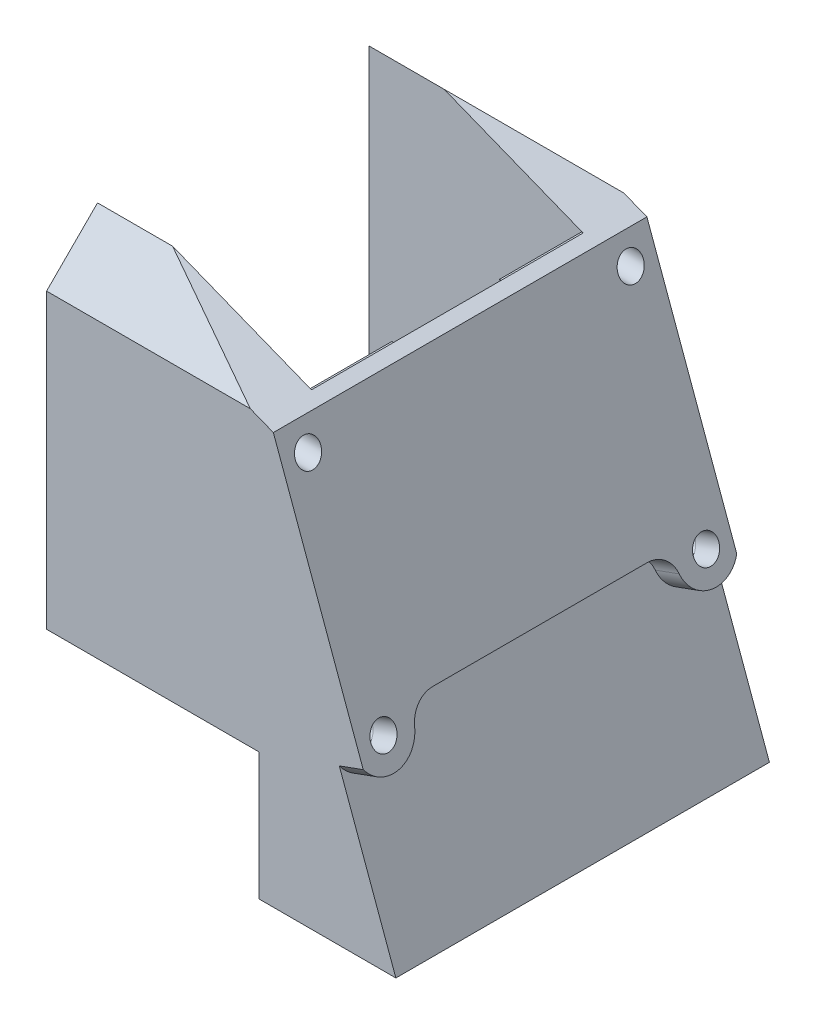
ISO-10303-21;
HEADER;
FILE_DESCRIPTION(('STEP AP214'),'2;1');
FILE_NAME('part.step','',(''),(''),'','','');
FILE_SCHEMA(('AUTOMOTIVE_DESIGN { 1 0 10303 214 1 1 1 1 }'));
ENDSEC;
DATA;
#1=APPLICATION_CONTEXT('core data for automotive mechanical design processes');
#2=APPLICATION_PROTOCOL_DEFINITION('international standard','automotive_design',2000,#1);
#3=PRODUCT_CONTEXT('',#1,'mechanical');
#4=PRODUCT('Part','Part','',(#3));
#5=PRODUCT_RELATED_PRODUCT_CATEGORY('part','',(#4));
#6=PRODUCT_DEFINITION_FORMATION('','',#4);
#7=PRODUCT_DEFINITION_CONTEXT('part definition',#1,'design');
#8=PRODUCT_DEFINITION('design','',#6,#7);
#9=PRODUCT_DEFINITION_SHAPE('','',#8);
#10=(LENGTH_UNIT() NAMED_UNIT(*) SI_UNIT(.MILLI.,.METRE.));
#11=(NAMED_UNIT(*) PLANE_ANGLE_UNIT() SI_UNIT($,.RADIAN.));
#12=(NAMED_UNIT(*) SI_UNIT($,.STERADIAN.) SOLID_ANGLE_UNIT());
#13=UNCERTAINTY_MEASURE_WITH_UNIT(LENGTH_MEASURE(1.E-05),#10,'distance_accuracy_value','');
#14=(GEOMETRIC_REPRESENTATION_CONTEXT(3) GLOBAL_UNCERTAINTY_ASSIGNED_CONTEXT((#13)) GLOBAL_UNIT_ASSIGNED_CONTEXT((#10,
#11,#12)) REPRESENTATION_CONTEXT('',''));
#15=CARTESIAN_POINT('',(0.,0.,0.));
#16=DIRECTION('',(0.,0.,1.));
#17=DIRECTION('',(1.,0.,0.));
#18=AXIS2_PLACEMENT_3D('',#15,#16,#17);
#19=CARTESIAN_POINT('',(2.36318819743866,0.860130161836886,0.));
#20=DIRECTION('',(0.939692620785907,0.342020143325673,0.));
#21=DIRECTION('',(-0.342020143325673,0.939692620785907,0.));
#22=AXIS2_PLACEMENT_3D('',#19,#20,#21);
#23=PLANE('',#22);
#24=CARTESIAN_POINT('',(8.86374395646739,-17.,-35.));
#25=DIRECTION('',(0.939692620785907,0.342020143325673,0.));
#26=DIRECTION('',(-0.342020143325673,0.939692620785907,0.));
#27=AXIS2_PLACEMENT_3D('',#24,#25,#26);
#28=CIRCLE('',#27,3.5);
#29=CARTESIAN_POINT('',(9.11705625753548,-17.6959698272547,-31.5792604779553));
#30=VERTEX_POINT('',#29);
#31=CARTESIAN_POINT('',(9.4803295384685,-18.6940549637093,-38.));
#32=VERTEX_POINT('',#31);
#33=EDGE_CURVE('E229',#30,#32,#28,.T.);
#34=ORIENTED_EDGE('',*,*,#33,.F.);
#35=CARTESIAN_POINT('',(9.33418108702241,-18.292515393473,-28.6471980304884));
#36=DIRECTION('',(0.939692620785907,0.342020143325673,0.));
#37=DIRECTION('',(-0.342020143325673,0.939692620785907,0.));
#38=AXIS2_PLACEMENT_3D('',#35,#36,#37);
#39=CIRCLE('',#38,3.);
#40=CARTESIAN_POINT('',(8.30812065704539,-15.4734375311152,-28.6471980304884));
#41=VERTEX_POINT('',#40);
#42=EDGE_CURVE('E377',#30,#41,#39,.T.);
#43=ORIENTED_EDGE('',*,*,#42,.T.);
#44=DIRECTION('',(0.,0.,1.));
#45=VECTOR('',#44,1.);
#46=CARTESIAN_POINT('',(8.30812065704539,-15.4734375311152,-38.));
#47=LINE('',#46,#45);
#48=CARTESIAN_POINT('',(8.30812065704539,-15.4734375311152,-3.35280196951161));
#49=VERTEX_POINT('',#48);
#50=EDGE_CURVE('E587',#41,#49,#47,.T.);
#51=ORIENTED_EDGE('',*,*,#50,.T.);
#52=CARTESIAN_POINT('',(9.33418108702241,-18.292515393473,-3.35280196951161));
#53=DIRECTION('',(0.939692620785907,0.342020143325673,0.));
#54=DIRECTION('',(-0.342020143325673,0.939692620785907,0.));
#55=AXIS2_PLACEMENT_3D('',#52,#53,#54);
#56=CIRCLE('',#55,3.);
#57=CARTESIAN_POINT('',(9.11705625753548,-17.6959698272547,-0.42073952204471));
#58=VERTEX_POINT('',#57);
#59=EDGE_CURVE('E379',#49,#58,#56,.T.);
#60=ORIENTED_EDGE('',*,*,#59,.T.);
#61=CARTESIAN_POINT('',(8.86374395646739,-17.,3.));
#62=DIRECTION('',(0.939692620785907,0.342020143325673,0.));
#63=DIRECTION('',(-0.342020143325673,0.939692620785907,0.));
#64=AXIS2_PLACEMENT_3D('',#61,#62,#63);
#65=CIRCLE('',#64,3.5);
#66=CARTESIAN_POINT('',(9.48032953846851,-18.6940549637094,5.99999999999999));
#67=VERTEX_POINT('',#66);
#68=EDGE_CURVE('E244',#67,#58,#65,.T.);
#69=ORIENTED_EDGE('',*,*,#68,.F.);
#70=DIRECTION('',(0.342020143325673,-0.939692620785907,0.));
#71=VECTOR('',#70,1.);
#72=CARTESIAN_POINT('',(8.30812065704539,-15.4734375311152,5.99999999999999));
#73=LINE('',#72,#71);
#74=CARTESIAN_POINT('',(16.1431486417915,-37.,6.00000000000001));
#75=VERTEX_POINT('',#74);
#76=EDGE_CURVE('E387',#67,#75,#73,.T.);
#77=ORIENTED_EDGE('',*,*,#76,.T.);
#78=DIRECTION('',(0.,0.,-1.));
#79=VECTOR('',#78,1.);
#80=CARTESIAN_POINT('',(16.1431486417915,-37.,79.8014410075375));
#81=LINE('',#80,#79);
#82=CARTESIAN_POINT('',(16.1431486417915,-37.,-38.));
#83=VERTEX_POINT('',#82);
#84=EDGE_CURVE('E580',#75,#83,#81,.T.);
#85=ORIENTED_EDGE('',*,*,#84,.T.);
#86=DIRECTION('',(-0.342020143325673,0.939692620785907,0.));
#87=VECTOR('',#86,1.);
#88=CARTESIAN_POINT('',(16.5166040968615,-38.026060429977,-38.));
#89=LINE('',#88,#87);
#90=EDGE_CURVE('E585',#83,#32,#89,.T.);
#91=ORIENTED_EDGE('',*,*,#90,.T.);
#92=EDGE_LOOP('',(#34,#43,#51,#60,#69,#77,#85,#91));
#93=FACE_BOUND('',#92,.T.);
#94=ADVANCED_FACE('F36',(#93),#23,.T.);
#95=CARTESIAN_POINT('',(8.30812065704539,-15.4734375311152,-38.));
#96=DIRECTION('',(-0.342020143325673,0.939692620785907,0.));
#97=DIRECTION('',(-0.939692620785907,-0.342020143325673,0.));
#98=AXIS2_PLACEMENT_3D('',#95,#96,#97);
#99=PLANE('',#98);
#100=ORIENTED_EDGE('',*,*,#50,.F.);
#101=DIRECTION('',(0.939692620785907,0.342020143325673,0.));
#102=VECTOR('',#101,1.);
#103=CARTESIAN_POINT('',(11.1271985194031,-14.4473771011382,-28.6471980304884));
#104=LINE('',#103,#102);
#105=CARTESIAN_POINT('',(11.1271985194031,-14.4473771011382,-28.6471980304884));
#106=VERTEX_POINT('',#105);
#107=EDGE_CURVE('E369',#41,#106,#104,.T.);
#108=ORIENTED_EDGE('',*,*,#107,.T.);
#109=DIRECTION('',(0.,0.,1.));
#110=VECTOR('',#109,1.);
#111=CARTESIAN_POINT('',(11.1271985194031,-14.4473771011382,-38.));
#112=LINE('',#111,#110);
#113=CARTESIAN_POINT('',(11.1271985194031,-14.4473771011382,-3.35280196951161));
#114=VERTEX_POINT('',#113);
#115=EDGE_CURVE('E241',#106,#114,#112,.T.);
#116=ORIENTED_EDGE('',*,*,#115,.T.);
#117=DIRECTION('',(0.939692620785907,0.342020143325673,0.));
#118=VECTOR('',#117,1.);
#119=CARTESIAN_POINT('',(8.30812065704539,-15.4734375311152,-3.35280196951161));
#120=LINE('',#119,#118);
#121=EDGE_CURVE('E374',#114,#49,#120,.F.);
#122=ORIENTED_EDGE('',*,*,#121,.T.);
#123=EDGE_LOOP('',(#100,#108,#116,#122));
#124=FACE_BOUND('',#123,.T.);
#125=ADVANCED_FACE('F257',(#124),#99,.F.);
#126=CARTESIAN_POINT('',(19.3356819592193,-37.,79.8014410075375));
#127=DIRECTION('',(0.,1.,0.));
#128=DIRECTION('',(-1.,0.,0.));
#129=AXIS2_PLACEMENT_3D('',#126,#127,#128);
#130=PLANE('',#129);
#131=ORIENTED_EDGE('',*,*,#84,.F.);
#132=DIRECTION('',(-1.,0.,0.));
#133=VECTOR('',#132,1.);
#134=CARTESIAN_POINT('',(19.3356819592193,-37.,6.00000000000001));
#135=LINE('',#134,#133);
#136=CARTESIAN_POINT('',(0.,-37.,6.00000000000001));
#137=VERTEX_POINT('',#136);
#138=EDGE_CURVE('E500',#75,#137,#135,.T.);
#139=ORIENTED_EDGE('',*,*,#138,.T.);
#140=DIRECTION('',(0.,0.,-1.));
#141=VECTOR('',#140,1.);
#142=CARTESIAN_POINT('',(0.,-37.,0.));
#143=LINE('',#142,#141);
#144=CARTESIAN_POINT('',(0.,-37.,-6.33380151290434));
#145=VERTEX_POINT('',#144);
#146=EDGE_CURVE('E419',#137,#145,#143,.T.);
#147=ORIENTED_EDGE('',*,*,#146,.T.);
#148=CARTESIAN_POINT('',(-9.75,-37.,-13.75));
#149=DIRECTION('',(0.,1.,0.));
#150=DIRECTION('',(-1.,0.,0.));
#151=AXIS2_PLACEMENT_3D('',#148,#149,#150);
#152=CIRCLE('',#151,12.25);
#153=CARTESIAN_POINT('',(0.,-37.,-21.1661984870957));
#154=VERTEX_POINT('',#153);
#155=EDGE_CURVE('E417',#145,#154,#152,.T.);
#156=ORIENTED_EDGE('',*,*,#155,.T.);
#157=DIRECTION('',(0.,0.,1.));
#158=VECTOR('',#157,1.);
#159=CARTESIAN_POINT('',(0.,-37.,0.));
#160=LINE('',#159,#158);
#161=CARTESIAN_POINT('',(0.,-37.,-38.));
#162=VERTEX_POINT('',#161);
#163=EDGE_CURVE('E413',#162,#154,#160,.T.);
#164=ORIENTED_EDGE('',*,*,#163,.F.);
#165=DIRECTION('',(1.,0.,0.));
#166=VECTOR('',#165,1.);
#167=CARTESIAN_POINT('',(19.3356819592193,-37.,-38.));
#168=LINE('',#167,#166);
#169=EDGE_CURVE('E214',#162,#83,#168,.T.);
#170=ORIENTED_EDGE('',*,*,#169,.T.);
#171=EDGE_LOOP('',(#131,#139,#147,#156,#164,#170));
#172=FACE_BOUND('',#171,.T.);
#173=ADVANCED_FACE('F261',(#172),#130,.F.);
#174=CARTESIAN_POINT('',(19.3356819592193,-17.,-35.));
#175=DIRECTION('',(-1.,0.,0.));
#176=DIRECTION('',(0.,0.,1.));
#177=AXIS2_PLACEMENT_3D('',#174,#175,#176);
#178=CYLINDRICAL_SURFACE('',#177,1.5);
#179=CARTESIAN_POINT('',(-25.,-17.,-35.));
#180=DIRECTION('',(-1.,0.,0.));
#181=DIRECTION('',(0.,0.,1.));
#182=AXIS2_PLACEMENT_3D('',#179,#180,#181);
#183=CIRCLE('',#182,1.5);
#184=CARTESIAN_POINT('',(-25.,-17.,-33.5));
#185=VERTEX_POINT('',#184);
#186=EDGE_CURVE('E567',#185,#185,#183,.T.);
#187=ORIENTED_EDGE('',*,*,#186,.T.);
#188=EDGE_LOOP('',(#187));
#189=FACE_BOUND('',#188,.T.);
#190=CARTESIAN_POINT('',(8.86374395646739,-17.,-35.));
#191=DIRECTION('',(0.939692620785907,0.342020143325673,0.));
#192=DIRECTION('',(-0.342020143325673,0.939692620785907,0.));
#193=AXIS2_PLACEMENT_3D('',#190,#191,#192);
#194=ELLIPSE('',#193,1.59626665871387,1.5);
#195=CARTESIAN_POINT('',(8.31778860506808,-15.5,-35.));
#196=VERTEX_POINT('',#195);
#197=EDGE_CURVE('E386',#196,#196,#194,.F.);
#198=ORIENTED_EDGE('',*,*,#197,.F.);
#199=EDGE_LOOP('',(#198));
#200=FACE_BOUND('',#199,.T.);
#201=ADVANCED_FACE('F271',(#189,#200),#178,.F.);
#202=CARTESIAN_POINT('',(19.3356819592193,-17.,3.));
#203=DIRECTION('',(-1.,0.,0.));
#204=DIRECTION('',(0.,0.,1.));
#205=AXIS2_PLACEMENT_3D('',#202,#203,#204);
#206=CYLINDRICAL_SURFACE('',#205,1.5);
#207=CARTESIAN_POINT('',(-25.,-17.,3.));
#208=DIRECTION('',(-1.,0.,0.));
#209=DIRECTION('',(0.,0.,1.));
#210=AXIS2_PLACEMENT_3D('',#207,#208,#209);
#211=CIRCLE('',#210,1.5);
#212=CARTESIAN_POINT('',(-25.,-17.,4.5));
#213=VERTEX_POINT('',#212);
#214=EDGE_CURVE('E391',#213,#213,#211,.T.);
#215=ORIENTED_EDGE('',*,*,#214,.T.);
#216=EDGE_LOOP('',(#215));
#217=FACE_BOUND('',#216,.T.);
#218=CARTESIAN_POINT('',(8.86374395646738,-17.,3.));
#219=DIRECTION('',(0.939692620785907,0.342020143325673,0.));
#220=DIRECTION('',(-0.342020143325673,0.939692620785907,0.));
#221=AXIS2_PLACEMENT_3D('',#218,#219,#220);
#222=ELLIPSE('',#221,1.59626665871387,1.5);
#223=CARTESIAN_POINT('',(8.31778860506807,-15.5,3.));
#224=VERTEX_POINT('',#223);
#225=EDGE_CURVE('E383',#224,#224,#222,.F.);
#226=ORIENTED_EDGE('',*,*,#225,.F.);
#227=EDGE_LOOP('',(#226));
#228=FACE_BOUND('',#227,.T.);
#229=ADVANCED_FACE('F267',(#217,#228),#206,.F.);
#230=CARTESIAN_POINT('',(2.5,-22.,79.8014410075375));
#231=DIRECTION('',(0.,1.,0.));
#232=DIRECTION('',(-1.,0.,0.));
#233=AXIS2_PLACEMENT_3D('',#230,#231,#232);
#234=PLANE('',#233);
#235=DIRECTION('',(0.,0.,1.));
#236=VECTOR('',#235,1.);
#237=CARTESIAN_POINT('',(0.,-22.,-84.6990789426149));
#238=LINE('',#237,#236);
#239=CARTESIAN_POINT('',(0.,-22.,-21.1661984870957));
#240=VERTEX_POINT('',#239);
#241=CARTESIAN_POINT('',(0.,-22.,-6.33380151290434));
#242=VERTEX_POINT('',#241);
#243=EDGE_CURVE('E465',#240,#242,#238,.T.);
#244=ORIENTED_EDGE('',*,*,#243,.F.);
#245=CARTESIAN_POINT('',(-9.75,-22.,-13.75));
#246=DIRECTION('',(0.,-1.,0.));
#247=DIRECTION('',(1.,0.,0.));
#248=AXIS2_PLACEMENT_3D('',#245,#246,#247);
#249=CIRCLE('',#248,12.25);
#250=EDGE_CURVE('E412',#240,#242,#249,.T.);
#251=ORIENTED_EDGE('',*,*,#250,.T.);
#252=EDGE_LOOP('',(#244,#251));
#253=FACE_BOUND('',#252,.T.);
#254=ADVANCED_FACE('F270',(#253),#234,.F.);
#255=CARTESIAN_POINT('',(0.2,0.,-84.6990789426149));
#256=DIRECTION('',(-1.,0.,0.));
#257=DIRECTION('',(0.,0.,1.));
#258=AXIS2_PLACEMENT_3D('',#255,#256,#257);
#259=PLANE('',#258);
#260=CARTESIAN_POINT('',(0.2,8.,-16.));
#261=DIRECTION('',(-1.,0.,0.));
#262=DIRECTION('',(0.,0.,1.));
#263=AXIS2_PLACEMENT_3D('',#260,#261,#262);
#264=CIRCLE('',#263,7.5);
#265=CARTESIAN_POINT('',(0.2,1.35,-12.531931373228));
#266=VERTEX_POINT('',#265);
#267=CARTESIAN_POINT('',(0.2,12.0237118604036,-9.67072335377515));
#268=VERTEX_POINT('',#267);
#269=EDGE_CURVE('E437',#266,#268,#264,.T.);
#270=ORIENTED_EDGE('',*,*,#269,.T.);
#271=DIRECTION('',(0.,0.,1.));
#272=VECTOR('',#271,1.);
#273=CARTESIAN_POINT('',(0.2,12.0237118604036,-84.6990789426149));
#274=LINE('',#273,#272);
#275=CARTESIAN_POINT('',(0.2,12.0237118604036,-22.3292766462248));
#276=VERTEX_POINT('',#275);
#277=EDGE_CURVE('E468',#276,#268,#274,.T.);
#278=ORIENTED_EDGE('',*,*,#277,.F.);
#279=CARTESIAN_POINT('',(0.2,8.,-16.));
#280=DIRECTION('',(-1.,0.,0.));
#281=DIRECTION('',(0.,0.,1.));
#282=AXIS2_PLACEMENT_3D('',#279,#280,#281);
#283=CIRCLE('',#282,7.5);
#284=CARTESIAN_POINT('',(0.2,1.35,-19.468068626772));
#285=VERTEX_POINT('',#284);
#286=EDGE_CURVE('E435',#276,#285,#283,.T.);
#287=ORIENTED_EDGE('',*,*,#286,.T.);
#288=DIRECTION('',(0.,0.,1.));
#289=VECTOR('',#288,1.);
#290=CARTESIAN_POINT('',(0.2,1.35,-84.6990789426149));
#291=LINE('',#290,#289);
#292=EDGE_CURVE('E482',#285,#266,#291,.T.);
#293=ORIENTED_EDGE('',*,*,#292,.T.);
#294=EDGE_LOOP('',(#270,#278,#287,#293));
#295=FACE_BOUND('',#294,.T.);
#296=ADVANCED_FACE('F323',(#295),#259,.T.);
#297=CARTESIAN_POINT('',(0.,0.,0.));
#298=DIRECTION('',(0.,0.,1.));
#299=DIRECTION('',(1.,0.,0.));
#300=AXIS2_PLACEMENT_3D('',#297,#298,#299);
#301=PLANE('',#300);
#302=DIRECTION('',(1.,0.,0.));
#303=VECTOR('',#302,1.);
#304=CARTESIAN_POINT('',(-16.4613920681763,12.0237118604036,0.));
#305=LINE('',#304,#303);
#306=CARTESIAN_POINT('',(0.,12.0237118604036,0.));
#307=VERTEX_POINT('',#306);
#308=CARTESIAN_POINT('',(0.2,12.0237118604036,0.));
#309=VERTEX_POINT('',#308);
#310=EDGE_CURVE('E443',#307,#309,#305,.T.);
#311=ORIENTED_EDGE('',*,*,#310,.F.);
#312=DIRECTION('',(0.,1.,0.));
#313=VECTOR('',#312,1.);
#314=CARTESIAN_POINT('',(0.,0.,0.));
#315=LINE('',#314,#313);
#316=CARTESIAN_POINT('',(0.,-22.,0.));
#317=VERTEX_POINT('',#316);
#318=EDGE_CURVE('E454',#317,#307,#315,.T.);
#319=ORIENTED_EDGE('',*,*,#318,.F.);
#320=DIRECTION('',(1.,0.,0.));
#321=VECTOR('',#320,1.);
#322=CARTESIAN_POINT('',(2.5,-22.,0.));
#323=LINE('',#322,#321);
#324=CARTESIAN_POINT('',(-25.,-22.,0.));
#325=VERTEX_POINT('',#324);
#326=EDGE_CURVE('E510',#325,#317,#323,.T.);
#327=ORIENTED_EDGE('',*,*,#326,.F.);
#328=DIRECTION('',(0.,-1.,0.));
#329=VECTOR('',#328,1.);
#330=CARTESIAN_POINT('',(-25.,-22.,0.));
#331=LINE('',#330,#329);
#332=CARTESIAN_POINT('',(-25.,18.5,0.));
#333=VERTEX_POINT('',#332);
#334=EDGE_CURVE('E497',#333,#325,#331,.T.);
#335=ORIENTED_EDGE('',*,*,#334,.F.);
#336=DIRECTION('',(-1.,0.,0.));
#337=VECTOR('',#336,1.);
#338=CARTESIAN_POINT('',(19.3356819592193,18.5,0.));
#339=LINE('',#338,#337);
#340=CARTESIAN_POINT('',(-16.1590364306008,18.5,0.));
#341=VERTEX_POINT('',#340);
#342=EDGE_CURVE('E492',#341,#333,#339,.T.);
#343=ORIENTED_EDGE('',*,*,#342,.F.);
#344=DIRECTION('',(-0.929790347501165,0.368089540320915,0.));
#345=VECTOR('',#344,1.);
#346=CARTESIAN_POINT('',(-25.,22.,0.));
#347=LINE('',#346,#345);
#348=EDGE_CURVE('E518',#309,#341,#347,.T.);
#349=ORIENTED_EDGE('',*,*,#348,.F.);
#350=EDGE_LOOP('',(#311,#319,#327,#335,#343,#349));
#351=FACE_BOUND('',#350,.T.);
#352=ADVANCED_FACE('F326',(#351),#301,.F.);
#353=CARTESIAN_POINT('',(-25.,22.,79.8014410075375));
#354=DIRECTION('',(-0.368089540320915,-0.929790347501165,0.));
#355=DIRECTION('',(0.929790347501165,-0.368089540320915,0.));
#356=AXIS2_PLACEMENT_3D('',#353,#354,#355);
#357=PLANE('',#356);
#358=DIRECTION('',(-0.929790347501165,0.368089540320915,0.));
#359=VECTOR('',#358,1.);
#360=CARTESIAN_POINT('',(-25.,22.,-38.));
#361=LINE('',#360,#359);
#362=CARTESIAN_POINT('',(1.71010071662838,11.4258864687808,-38.));
#363=VERTEX_POINT('',#362);
#364=CARTESIAN_POINT('',(-1.00309888305935,12.4999999999999,-38.));
#365=VERTEX_POINT('',#364);
#366=EDGE_CURVE('E211',#363,#365,#361,.T.);
#367=ORIENTED_EDGE('',*,*,#366,.T.);
#368=DIRECTION('',(-0.872556169616714,0.345431419288844,0.345431419288842));
#369=VECTOR('',#368,1.);
#370=CARTESIAN_POINT('',(-57.6429549631125,34.9228382714237,-15.5771617285764));
#371=LINE('',#370,#369);
#372=CARTESIAN_POINT('',(-16.1590364306008,18.5,-32.));
#373=VERTEX_POINT('',#372);
#374=EDGE_CURVE('E549',#365,#373,#371,.T.);
#375=ORIENTED_EDGE('',*,*,#374,.T.);
#376=DIRECTION('',(0.929790347501165,-0.368089540320915,0.));
#377=VECTOR('',#376,1.);
#378=CARTESIAN_POINT('',(-25.,22.,-32.));
#379=LINE('',#378,#377);
#380=CARTESIAN_POINT('',(0.2,12.0237118604036,-32.));
#381=VERTEX_POINT('',#380);
#382=EDGE_CURVE('E393',#373,#381,#379,.T.);
#383=ORIENTED_EDGE('',*,*,#382,.T.);
#384=EDGE_CURVE('E486',#381,#276,#274,.T.);
#385=ORIENTED_EDGE('',*,*,#384,.T.);
#386=ORIENTED_EDGE('',*,*,#277,.T.);
#387=DIRECTION('',(0.,0.,-1.));
#388=VECTOR('',#387,1.);
#389=CARTESIAN_POINT('',(0.2,12.0237118604036,0.));
#390=LINE('',#389,#388);
#391=EDGE_CURVE('E439',#309,#268,#390,.T.);
#392=ORIENTED_EDGE('',*,*,#391,.F.);
#393=ORIENTED_EDGE('',*,*,#348,.T.);
#394=DIRECTION('',(-0.872556169616714,0.345431419288843,-0.345431419288843));
#395=VECTOR('',#394,1.);
#396=CARTESIAN_POINT('',(0.107747061114126,12.0602333643739,6.43976663562609));
#397=LINE('',#396,#395);
#398=CARTESIAN_POINT('',(-1.00309888305948,12.5,5.99999999999999));
#399=VERTEX_POINT('',#398);
#400=EDGE_CURVE('E494',#399,#341,#397,.T.);
#401=ORIENTED_EDGE('',*,*,#400,.F.);
#402=DIRECTION('',(0.929790347501165,-0.368089540320915,0.));
#403=VECTOR('',#402,1.);
#404=CARTESIAN_POINT('',(-25.,22.,5.99999999999999));
#405=LINE('',#404,#403);
#406=CARTESIAN_POINT('',(1.71010071662837,11.4258864687808,5.99999999999999));
#407=VERTEX_POINT('',#406);
#408=EDGE_CURVE('E501',#399,#407,#405,.T.);
#409=ORIENTED_EDGE('',*,*,#408,.T.);
#410=DIRECTION('',(0.,0.,-1.));
#411=VECTOR('',#410,1.);
#412=CARTESIAN_POINT('',(1.71010071662837,11.4258864687808,79.8014410075375));
#413=LINE('',#412,#411);
#414=EDGE_CURVE('E539',#407,#363,#413,.T.);
#415=ORIENTED_EDGE('',*,*,#414,.T.);
#416=EDGE_LOOP('',(#367,#375,#383,#385,#386,#392,#393,#401,#409,#415));
#417=FACE_BOUND('',#416,.T.);
#418=ADVANCED_FACE('F342',(#417),#357,.F.);
#419=CARTESIAN_POINT('',(-25.,-22.,79.8014410075375));
#420=DIRECTION('',(1.,0.,0.));
#421=DIRECTION('',(0.,1.,0.));
#422=AXIS2_PLACEMENT_3D('',#419,#420,#421);
#423=PLANE('',#422);
#424=CARTESIAN_POINT('',(-25.,8.42893218813451,2.99999999999999));
#425=DIRECTION('',(-1.,0.,0.));
#426=DIRECTION('',(0.,0.,1.));
#427=AXIS2_PLACEMENT_3D('',#424,#425,#426);
#428=CIRCLE('',#427,1.5);
#429=CARTESIAN_POINT('',(-25.,8.42893218813451,4.5));
#430=VERTEX_POINT('',#429);
#431=EDGE_CURVE('E392',#430,#430,#428,.T.);
#432=ORIENTED_EDGE('',*,*,#431,.F.);
#433=EDGE_LOOP('',(#432));
#434=FACE_BOUND('',#433,.T.);
#435=ORIENTED_EDGE('',*,*,#214,.F.);
#436=EDGE_LOOP('',(#435));
#437=FACE_BOUND('',#436,.T.);
#438=DIRECTION('',(0.,0.707106781186548,-0.707106781186547));
#439=VECTOR('',#438,1.);
#440=CARTESIAN_POINT('',(-25.,9.24999999999997,9.24999999999999));
#441=LINE('',#440,#439);
#442=CARTESIAN_POINT('',(-25.,12.5,5.99999999999999));
#443=VERTEX_POINT('',#442);
#444=EDGE_CURVE('E489',#443,#333,#441,.T.);
#445=ORIENTED_EDGE('',*,*,#444,.T.);
#446=ORIENTED_EDGE('',*,*,#334,.T.);
#447=DIRECTION('',(0.,0.,-1.));
#448=VECTOR('',#447,1.);
#449=CARTESIAN_POINT('',(-25.,-22.,79.8014410075375));
#450=LINE('',#449,#448);
#451=CARTESIAN_POINT('',(-25.,-22.,6.00000000000001));
#452=VERTEX_POINT('',#451);
#453=EDGE_CURVE('E540',#452,#325,#450,.T.);
#454=ORIENTED_EDGE('',*,*,#453,.F.);
#455=DIRECTION('',(0.,1.,0.));
#456=VECTOR('',#455,1.);
#457=CARTESIAN_POINT('',(-25.,-22.,6.00000000000001));
#458=LINE('',#457,#456);
#459=EDGE_CURVE('E505',#452,#443,#458,.T.);
#460=ORIENTED_EDGE('',*,*,#459,.T.);
#461=EDGE_LOOP('',(#445,#446,#454,#460));
#462=FACE_BOUND('',#461,.T.);
#463=ADVANCED_FACE('F338',(#434,#437,#462),#423,.F.);
#464=CARTESIAN_POINT('',(-29.,12.5,5.99999999999999));
#465=DIRECTION('',(0.,0.,-1.));
#466=DIRECTION('',(0.,-1.,0.));
#467=AXIS2_PLACEMENT_3D('',#464,#465,#466);
#468=PLANE('',#467);
#469=ORIENTED_EDGE('',*,*,#76,.F.);
#470=DIRECTION('',(-0.939692620785907,-0.342020143325673,0.));
#471=VECTOR('',#470,1.);
#472=CARTESIAN_POINT('',(20.0773634598856,-14.8370500448043,6.));
#473=LINE('',#472,#471);
#474=CARTESIAN_POINT('',(12.2994074008262,-17.6679945337324,6.));
#475=VERTEX_POINT('',#474);
#476=EDGE_CURVE('E238',#475,#67,#473,.T.);
#477=ORIENTED_EDGE('',*,*,#476,.F.);
#478=DIRECTION('',(0.342020143325673,-0.939692620785907,0.));
#479=VECTOR('',#478,1.);
#480=CARTESIAN_POINT('',(1.71010071662838,11.4258864687808,5.99999999999999));
#481=LINE('',#480,#479);
#482=EDGE_CURVE('E498',#407,#475,#481,.T.);
#483=ORIENTED_EDGE('',*,*,#482,.F.);
#484=ORIENTED_EDGE('',*,*,#408,.F.);
#485=DIRECTION('',(1.,0.,0.));
#486=VECTOR('',#485,1.);
#487=CARTESIAN_POINT('',(-29.,12.5,5.99999999999999));
#488=LINE('',#487,#486);
#489=EDGE_CURVE('E508',#443,#399,#488,.T.);
#490=ORIENTED_EDGE('',*,*,#489,.F.);
#491=ORIENTED_EDGE('',*,*,#459,.F.);
#492=DIRECTION('',(-1.,0.,0.));
#493=VECTOR('',#492,1.);
#494=CARTESIAN_POINT('',(2.5,-22.,6.00000000000001));
#495=LINE('',#494,#493);
#496=CARTESIAN_POINT('',(0.,-22.,6.00000000000001));
#497=VERTEX_POINT('',#496);
#498=EDGE_CURVE('E503',#497,#452,#495,.T.);
#499=ORIENTED_EDGE('',*,*,#498,.F.);
#500=DIRECTION('',(0.,1.,0.));
#501=VECTOR('',#500,1.);
#502=CARTESIAN_POINT('',(0.,-56.9075990516184,6.00000000000001));
#503=LINE('',#502,#501);
#504=EDGE_CURVE('E420',#137,#497,#503,.T.);
#505=ORIENTED_EDGE('',*,*,#504,.F.);
#506=ORIENTED_EDGE('',*,*,#138,.F.);
#507=EDGE_LOOP('',(#469,#477,#483,#484,#490,#491,#499,#505,#506));
#508=FACE_BOUND('',#507,.T.);
#509=ADVANCED_FACE('F335',(#508),#468,.F.);
#510=CARTESIAN_POINT('',(1.71010071662837,11.4258864687808,79.8014410075375));
#511=DIRECTION('',(-0.939692620785907,-0.342020143325673,0.));
#512=DIRECTION('',(0.342020143325673,-0.939692620785907,0.));
#513=AXIS2_PLACEMENT_3D('',#510,#511,#512);
#514=PLANE('',#513);
#515=CARTESIAN_POINT('',(2.80090286824031,8.4289321881345,3.));
#516=DIRECTION('',(-0.939692620785907,-0.342020143325673,0.));
#517=DIRECTION('',(-0.342020143325673,0.939692620785907,0.));
#518=AXIS2_PLACEMENT_3D('',#515,#516,#517);
#519=ELLIPSE('',#518,1.59626665871387,1.5);
#520=CARTESIAN_POINT('',(2.254947516841,9.92893218813451,3.));
#521=VERTEX_POINT('',#520);
#522=EDGE_CURVE('E388',#521,#521,#519,.T.);
#523=ORIENTED_EDGE('',*,*,#522,.T.);
#524=EDGE_LOOP('',(#523));
#525=FACE_BOUND('',#524,.T.);
#526=CARTESIAN_POINT('',(2.80090286824032,8.42893218813449,-35.));
#527=DIRECTION('',(-0.939692620785907,-0.342020143325673,0.));
#528=DIRECTION('',(-0.342020143325673,0.939692620785907,0.));
#529=AXIS2_PLACEMENT_3D('',#526,#527,#528);
#530=ELLIPSE('',#529,1.59626665871387,1.5);
#531=CARTESIAN_POINT('',(2.25494751684101,9.9289321881345,-35.));
#532=VERTEX_POINT('',#531);
#533=EDGE_CURVE('E561',#532,#532,#530,.T.);
#534=ORIENTED_EDGE('',*,*,#533,.T.);
#535=EDGE_LOOP('',(#534));
#536=FACE_BOUND('',#535,.T.);
#537=ORIENTED_EDGE('',*,*,#482,.T.);
#538=CARTESIAN_POINT('',(11.6828218188251,-15.973939570023,3.));
#539=DIRECTION('',(-0.939692620785907,-0.342020143325673,0.));
#540=DIRECTION('',(0.342020143325673,-0.939692620785907,0.));
#541=AXIS2_PLACEMENT_3D('',#538,#539,#540);
#542=CIRCLE('',#541,3.5);
#543=CARTESIAN_POINT('',(11.9361341198932,-16.6699093972776,-0.42073952204471));
#544=VERTEX_POINT('',#543);
#545=EDGE_CURVE('E235',#544,#475,#542,.T.);
#546=ORIENTED_EDGE('',*,*,#545,.F.);
#547=CARTESIAN_POINT('',(12.1532589493801,-17.2664549634959,-3.35280196951161));
#548=DIRECTION('',(-0.939692620785907,-0.342020143325673,0.));
#549=DIRECTION('',(0.342020143325673,-0.939692620785907,0.));
#550=AXIS2_PLACEMENT_3D('',#547,#548,#549);
#551=CIRCLE('',#550,3.);
#552=EDGE_CURVE('E12',#544,#114,#551,.T.);
#553=ORIENTED_EDGE('',*,*,#552,.T.);
#554=ORIENTED_EDGE('',*,*,#115,.F.);
#555=CARTESIAN_POINT('',(12.1532589493801,-17.2664549634959,-28.6471980304884));
#556=DIRECTION('',(-0.939692620785907,-0.342020143325673,0.));
#557=DIRECTION('',(0.342020143325673,-0.939692620785907,0.));
#558=AXIS2_PLACEMENT_3D('',#555,#556,#557);
#559=CIRCLE('',#558,3.);
#560=CARTESIAN_POINT('',(11.9361341198932,-16.6699093972777,-31.5792604779553));
#561=VERTEX_POINT('',#560);
#562=EDGE_CURVE('E44',#106,#561,#559,.T.);
#563=ORIENTED_EDGE('',*,*,#562,.T.);
#564=CARTESIAN_POINT('',(11.6828218188251,-15.973939570023,-35.));
#565=DIRECTION('',(-0.939692620785907,-0.342020143325673,0.));
#566=DIRECTION('',(0.342020143325673,-0.939692620785907,0.));
#567=AXIS2_PLACEMENT_3D('',#564,#565,#566);
#568=CIRCLE('',#567,3.5);
#569=CARTESIAN_POINT('',(12.2994074008262,-17.6679945337323,-38.));
#570=VERTEX_POINT('',#569);
#571=EDGE_CURVE('E217',#570,#561,#568,.T.);
#572=ORIENTED_EDGE('',*,*,#571,.F.);
#573=DIRECTION('',(-0.342020143325673,0.939692620785907,0.));
#574=VECTOR('',#573,1.);
#575=CARTESIAN_POINT('',(1.71010071662837,11.4258864687808,-38.));
#576=LINE('',#575,#574);
#577=EDGE_CURVE('E203',#570,#363,#576,.T.);
#578=ORIENTED_EDGE('',*,*,#577,.T.);
#579=ORIENTED_EDGE('',*,*,#414,.F.);
#580=EDGE_LOOP('',(#537,#546,#553,#554,#563,#572,#578,#579));
#581=FACE_BOUND('',#580,.T.);
#582=CARTESIAN_POINT('',(11.6828218188251,-15.973939570023,3.));
#583=DIRECTION('',(-0.939692620785907,-0.342020143325673,0.));
#584=DIRECTION('',(-0.342020143325673,0.939692620785907,0.));
#585=AXIS2_PLACEMENT_3D('',#582,#583,#584);
#586=ELLIPSE('',#585,1.59626665871387,1.5);
#587=CARTESIAN_POINT('',(11.1368664674258,-14.473939570023,3.));
#588=VERTEX_POINT('',#587);
#589=EDGE_CURVE('E237',#588,#588,#586,.F.);
#590=ORIENTED_EDGE('',*,*,#589,.F.);
#591=EDGE_LOOP('',(#590));
#592=FACE_BOUND('',#591,.T.);
#593=CARTESIAN_POINT('',(11.6828218188251,-15.973939570023,-35.));
#594=DIRECTION('',(-0.939692620785907,-0.342020143325673,0.));
#595=DIRECTION('',(-0.342020143325673,0.939692620785907,0.));
#596=AXIS2_PLACEMENT_3D('',#593,#594,#595);
#597=ELLIPSE('',#596,1.59626665871387,1.5);
#598=CARTESIAN_POINT('',(11.1368664674258,-14.473939570023,-35.));
#599=VERTEX_POINT('',#598);
#600=EDGE_CURVE('E225',#599,#599,#597,.F.);
#601=ORIENTED_EDGE('',*,*,#600,.F.);
#602=EDGE_LOOP('',(#601));
#603=FACE_BOUND('',#602,.T.);
#604=ADVANCED_FACE('F219',(#525,#536,#581,#592,#603),#514,.F.);
#605=ORIENTED_EDGE('',*,*,#326,.T.);
#606=DIRECTION('',(0.,0.,1.));
#607=VECTOR('',#606,1.);
#608=CARTESIAN_POINT('',(0.,-22.,0.));
#609=LINE('',#608,#607);
#610=EDGE_CURVE('E423',#317,#497,#609,.T.);
#611=ORIENTED_EDGE('',*,*,#610,.T.);
#612=ORIENTED_EDGE('',*,*,#498,.T.);
#613=ORIENTED_EDGE('',*,*,#453,.T.);
#614=EDGE_LOOP('',(#605,#611,#612,#613));
#615=FACE_BOUND('',#614,.T.);
#616=ADVANCED_FACE('F333',(#615),#234,.F.);
#617=CARTESIAN_POINT('',(19.3356819592193,9.24999999999997,9.24999999999999));
#618=DIRECTION('',(0.,0.707106781186547,0.707106781186548));
#619=DIRECTION('',(0.,-0.707106781186548,0.707106781186547));
#620=AXIS2_PLACEMENT_3D('',#617,#618,#619);
#621=PLANE('',#620);
#622=ORIENTED_EDGE('',*,*,#400,.T.);
#623=ORIENTED_EDGE('',*,*,#342,.T.);
#624=ORIENTED_EDGE('',*,*,#444,.F.);
#625=ORIENTED_EDGE('',*,*,#489,.T.);
#626=EDGE_LOOP('',(#622,#623,#624,#625));
#627=FACE_BOUND('',#626,.T.);
#628=ADVANCED_FACE('F321',(#627),#621,.T.);
#629=CARTESIAN_POINT('',(0.,0.,-84.6990789426149));
#630=DIRECTION('',(1.,0.,0.));
#631=DIRECTION('',(0.,0.,-1.));
#632=AXIS2_PLACEMENT_3D('',#629,#630,#631);
#633=PLANE('',#632);
#634=DIRECTION('',(0.,0.,1.));
#635=VECTOR('',#634,1.);
#636=CARTESIAN_POINT('',(0.,1.35,-84.6990789426149));
#637=LINE('',#636,#635);
#638=CARTESIAN_POINT('',(0.,1.35,-19.468068626772));
#639=VERTEX_POINT('',#638);
#640=CARTESIAN_POINT('',(0.,1.35,-12.531931373228));
#641=VERTEX_POINT('',#640);
#642=EDGE_CURVE('E469',#639,#641,#637,.T.);
#643=ORIENTED_EDGE('',*,*,#642,.F.);
#644=CARTESIAN_POINT('',(0.,8.,-16.));
#645=DIRECTION('',(1.,0.,0.));
#646=DIRECTION('',(0.,0.,-1.));
#647=AXIS2_PLACEMENT_3D('',#644,#645,#646);
#648=CIRCLE('',#647,7.5);
#649=CARTESIAN_POINT('',(0.,12.0237118604036,-22.3292766462248));
#650=VERTEX_POINT('',#649);
#651=EDGE_CURVE('E451',#639,#650,#648,.T.);
#652=ORIENTED_EDGE('',*,*,#651,.T.);
#653=DIRECTION('',(0.,0.,1.));
#654=VECTOR('',#653,1.);
#655=CARTESIAN_POINT('',(0.,12.0237118604036,0.));
#656=LINE('',#655,#654);
#657=CARTESIAN_POINT('',(0.,12.0237118604036,-32.));
#658=VERTEX_POINT('',#657);
#659=EDGE_CURVE('E448',#658,#650,#656,.T.);
#660=ORIENTED_EDGE('',*,*,#659,.F.);
#661=DIRECTION('',(0.,-1.,0.));
#662=VECTOR('',#661,1.);
#663=CARTESIAN_POINT('',(0.,0.,-32.));
#664=LINE('',#663,#662);
#665=CARTESIAN_POINT('',(0.,-22.,-32.));
#666=VERTEX_POINT('',#665);
#667=EDGE_CURVE('E485',#658,#666,#664,.T.);
#668=ORIENTED_EDGE('',*,*,#667,.T.);
#669=DIRECTION('',(0.,0.,-1.));
#670=VECTOR('',#669,1.);
#671=CARTESIAN_POINT('',(0.,-22.,-32.));
#672=LINE('',#671,#670);
#673=CARTESIAN_POINT('',(0.,-22.,-38.));
#674=VERTEX_POINT('',#673);
#675=EDGE_CURVE('E577',#666,#674,#672,.T.);
#676=ORIENTED_EDGE('',*,*,#675,.T.);
#677=DIRECTION('',(0.,-1.,0.));
#678=VECTOR('',#677,1.);
#679=CARTESIAN_POINT('',(0.,-15.5,-38.));
#680=LINE('',#679,#678);
#681=EDGE_CURVE('E574',#674,#162,#680,.T.);
#682=ORIENTED_EDGE('',*,*,#681,.T.);
#683=ORIENTED_EDGE('',*,*,#163,.T.);
#684=DIRECTION('',(0.,1.,0.));
#685=VECTOR('',#684,1.);
#686=CARTESIAN_POINT('',(0.,-56.9075990516184,-21.1661984870957));
#687=LINE('',#686,#685);
#688=EDGE_CURVE('E409',#154,#240,#687,.T.);
#689=ORIENTED_EDGE('',*,*,#688,.T.);
#690=ORIENTED_EDGE('',*,*,#243,.T.);
#691=DIRECTION('',(0.,1.,0.));
#692=VECTOR('',#691,1.);
#693=CARTESIAN_POINT('',(0.,-56.9075990516184,-6.33380151290434));
#694=LINE('',#693,#692);
#695=EDGE_CURVE('E426',#145,#242,#694,.T.);
#696=ORIENTED_EDGE('',*,*,#695,.F.);
#697=ORIENTED_EDGE('',*,*,#146,.F.);
#698=ORIENTED_EDGE('',*,*,#504,.T.);
#699=ORIENTED_EDGE('',*,*,#610,.F.);
#700=ORIENTED_EDGE('',*,*,#318,.T.);
#701=DIRECTION('',(0.,0.,1.));
#702=VECTOR('',#701,1.);
#703=CARTESIAN_POINT('',(0.,12.0237118604036,0.));
#704=LINE('',#703,#702);
#705=CARTESIAN_POINT('',(0.,12.0237118604036,-9.67072335377516));
#706=VERTEX_POINT('',#705);
#707=EDGE_CURVE('E436',#706,#307,#704,.T.);
#708=ORIENTED_EDGE('',*,*,#707,.F.);
#709=CARTESIAN_POINT('',(0.,8.,-16.));
#710=DIRECTION('',(1.,0.,0.));
#711=DIRECTION('',(0.,0.,-1.));
#712=AXIS2_PLACEMENT_3D('',#709,#710,#711);
#713=CIRCLE('',#712,7.5);
#714=EDGE_CURVE('E432',#706,#641,#713,.T.);
#715=ORIENTED_EDGE('',*,*,#714,.T.);
#716=EDGE_LOOP('',(#643,#652,#660,#668,#676,#682,#683,#689,#690,#696,#697,#698,#699,#700,#708,#715));
#717=FACE_BOUND('',#716,.T.);
#718=ADVANCED_FACE('F318',(#717),#633,.F.);
#719=CARTESIAN_POINT('',(0.,1.35,-84.6990789426149));
#720=DIRECTION('',(0.,1.,0.));
#721=DIRECTION('',(-1.,0.,0.));
#722=AXIS2_PLACEMENT_3D('',#719,#720,#721);
#723=PLANE('',#722);
#724=DIRECTION('',(1.,0.,0.));
#725=VECTOR('',#724,1.);
#726=CARTESIAN_POINT('',(-16.4613920681763,1.35,-12.531931373228));
#727=LINE('',#726,#725);
#728=EDGE_CURVE('E444',#641,#266,#727,.T.);
#729=ORIENTED_EDGE('',*,*,#728,.T.);
#730=ORIENTED_EDGE('',*,*,#292,.F.);
#731=DIRECTION('',(1.,0.,0.));
#732=VECTOR('',#731,1.);
#733=CARTESIAN_POINT('',(-16.4613920681763,1.35,-19.468068626772));
#734=LINE('',#733,#732);
#735=EDGE_CURVE('E457',#639,#285,#734,.T.);
#736=ORIENTED_EDGE('',*,*,#735,.F.);
#737=ORIENTED_EDGE('',*,*,#642,.T.);
#738=EDGE_LOOP('',(#729,#730,#736,#737));
#739=FACE_BOUND('',#738,.T.);
#740=ADVANCED_FACE('F313',(#739),#723,.T.);
#741=CARTESIAN_POINT('',(-16.4613920681763,12.0237118604036,0.));
#742=DIRECTION('',(0.,-1.,0.));
#743=DIRECTION('',(0.,0.,-1.));
#744=AXIS2_PLACEMENT_3D('',#741,#742,#743);
#745=PLANE('',#744);
#746=DIRECTION('',(1.,0.,0.));
#747=VECTOR('',#746,1.);
#748=CARTESIAN_POINT('',(-16.4613920681763,12.0237118604036,-32.));
#749=LINE('',#748,#747);
#750=EDGE_CURVE('E459',#658,#381,#749,.T.);
#751=ORIENTED_EDGE('',*,*,#750,.F.);
#752=ORIENTED_EDGE('',*,*,#659,.T.);
#753=DIRECTION('',(1.,0.,0.));
#754=VECTOR('',#753,1.);
#755=CARTESIAN_POINT('',(-16.4613920681763,12.0237118604036,-22.3292766462248));
#756=LINE('',#755,#754);
#757=EDGE_CURVE('E452',#650,#276,#756,.T.);
#758=ORIENTED_EDGE('',*,*,#757,.T.);
#759=ORIENTED_EDGE('',*,*,#384,.F.);
#760=EDGE_LOOP('',(#751,#752,#758,#759));
#761=FACE_BOUND('',#760,.T.);
#762=ADVANCED_FACE('F310',(#761),#745,.F.);
#763=CARTESIAN_POINT('',(-16.4613920681763,8.,-16.));
#764=DIRECTION('',(1.,0.,0.));
#765=DIRECTION('',(0.,0.,-1.));
#766=AXIS2_PLACEMENT_3D('',#763,#764,#765);
#767=CYLINDRICAL_SURFACE('',#766,7.5);
#768=ORIENTED_EDGE('',*,*,#651,.F.);
#769=ORIENTED_EDGE('',*,*,#735,.T.);
#770=ORIENTED_EDGE('',*,*,#286,.F.);
#771=ORIENTED_EDGE('',*,*,#757,.F.);
#772=EDGE_LOOP('',(#768,#769,#770,#771));
#773=FACE_BOUND('',#772,.T.);
#774=ADVANCED_FACE('F305',(#773),#767,.F.);
#775=CARTESIAN_POINT('',(-16.4613920681763,12.0237118604036,0.));
#776=DIRECTION('',(0.,-1.,0.));
#777=DIRECTION('',(0.,0.,-1.));
#778=AXIS2_PLACEMENT_3D('',#775,#776,#777);
#779=PLANE('',#778);
#780=DIRECTION('',(1.,0.,0.));
#781=VECTOR('',#780,1.);
#782=CARTESIAN_POINT('',(-16.4613920681763,12.0237118604036,-9.67072335377516));
#783=LINE('',#782,#781);
#784=EDGE_CURVE('E440',#706,#268,#783,.T.);
#785=ORIENTED_EDGE('',*,*,#784,.F.);
#786=ORIENTED_EDGE('',*,*,#707,.T.);
#787=ORIENTED_EDGE('',*,*,#310,.T.);
#788=ORIENTED_EDGE('',*,*,#391,.T.);
#789=EDGE_LOOP('',(#785,#786,#787,#788));
#790=FACE_BOUND('',#789,.T.);
#791=ADVANCED_FACE('F302',(#790),#779,.F.);
#792=CARTESIAN_POINT('',(-16.4613920681763,8.,-16.));
#793=DIRECTION('',(1.,0.,0.));
#794=DIRECTION('',(0.,0.,-1.));
#795=AXIS2_PLACEMENT_3D('',#792,#793,#794);
#796=CYLINDRICAL_SURFACE('',#795,7.5);
#797=ORIENTED_EDGE('',*,*,#714,.F.);
#798=ORIENTED_EDGE('',*,*,#784,.T.);
#799=ORIENTED_EDGE('',*,*,#269,.F.);
#800=ORIENTED_EDGE('',*,*,#728,.F.);
#801=EDGE_LOOP('',(#797,#798,#799,#800));
#802=FACE_BOUND('',#801,.T.);
#803=ADVANCED_FACE('F300',(#802),#796,.F.);
#804=CARTESIAN_POINT('',(-9.75,-56.9075990516184,-13.75));
#805=DIRECTION('',(0.,1.,0.));
#806=DIRECTION('',(-1.,0.,0.));
#807=AXIS2_PLACEMENT_3D('',#804,#805,#806);
#808=CYLINDRICAL_SURFACE('',#807,12.25);
#809=ORIENTED_EDGE('',*,*,#155,.F.);
#810=ORIENTED_EDGE('',*,*,#695,.T.);
#811=ORIENTED_EDGE('',*,*,#250,.F.);
#812=ORIENTED_EDGE('',*,*,#688,.F.);
#813=EDGE_LOOP('',(#809,#810,#811,#812));
#814=FACE_BOUND('',#813,.T.);
#815=ADVANCED_FACE('F290',(#814),#808,.F.);
#816=CARTESIAN_POINT('',(0.,0.,-32.));
#817=DIRECTION('',(0.,0.,1.));
#818=DIRECTION('',(1.,0.,0.));
#819=AXIS2_PLACEMENT_3D('',#816,#817,#818);
#820=PLANE('',#819);
#821=DIRECTION('',(-1.,0.,0.));
#822=VECTOR('',#821,1.);
#823=CARTESIAN_POINT('',(19.3356819592193,18.5,-32.));
#824=LINE('',#823,#822);
#825=CARTESIAN_POINT('',(-25.,18.5,-32.));
#826=VERTEX_POINT('',#825);
#827=EDGE_CURVE('E556',#373,#826,#824,.T.);
#828=ORIENTED_EDGE('',*,*,#827,.T.);
#829=DIRECTION('',(0.,1.,0.));
#830=VECTOR('',#829,1.);
#831=CARTESIAN_POINT('',(-25.,-22.,-32.));
#832=LINE('',#831,#830);
#833=CARTESIAN_POINT('',(-25.,-22.,-32.));
#834=VERTEX_POINT('',#833);
#835=EDGE_CURVE('E397',#834,#826,#832,.T.);
#836=ORIENTED_EDGE('',*,*,#835,.F.);
#837=DIRECTION('',(-1.,0.,0.));
#838=VECTOR('',#837,1.);
#839=CARTESIAN_POINT('',(2.5,-22.,-32.));
#840=LINE('',#839,#838);
#841=EDGE_CURVE('E396',#666,#834,#840,.T.);
#842=ORIENTED_EDGE('',*,*,#841,.F.);
#843=ORIENTED_EDGE('',*,*,#667,.F.);
#844=ORIENTED_EDGE('',*,*,#750,.T.);
#845=ORIENTED_EDGE('',*,*,#382,.F.);
#846=EDGE_LOOP('',(#828,#836,#842,#843,#844,#845));
#847=FACE_BOUND('',#846,.T.);
#848=ADVANCED_FACE('F286',(#847),#820,.T.);
#849=CARTESIAN_POINT('',(2.50000000000001,-22.,-111.801441007538));
#850=DIRECTION('',(0.,1.,0.));
#851=DIRECTION('',(-1.,0.,0.));
#852=AXIS2_PLACEMENT_3D('',#849,#850,#851);
#853=PLANE('',#852);
#854=DIRECTION('',(1.,0.,0.));
#855=VECTOR('',#854,1.);
#856=CARTESIAN_POINT('',(2.50000000000001,-22.,-38.));
#857=LINE('',#856,#855);
#858=CARTESIAN_POINT('',(-25.,-22.,-38.));
#859=VERTEX_POINT('',#858);
#860=EDGE_CURVE('E407',#859,#674,#857,.T.);
#861=ORIENTED_EDGE('',*,*,#860,.T.);
#862=ORIENTED_EDGE('',*,*,#675,.F.);
#863=ORIENTED_EDGE('',*,*,#841,.T.);
#864=DIRECTION('',(0.,0.,1.));
#865=VECTOR('',#864,1.);
#866=CARTESIAN_POINT('',(-25.,-22.,-111.801441007538));
#867=LINE('',#866,#865);
#868=EDGE_CURVE('E404',#859,#834,#867,.T.);
#869=ORIENTED_EDGE('',*,*,#868,.F.);
#870=EDGE_LOOP('',(#861,#862,#863,#869));
#871=FACE_BOUND('',#870,.T.);
#872=ADVANCED_FACE('F289',(#871),#853,.F.);
#873=CARTESIAN_POINT('',(-25.,-22.,-111.801441007538));
#874=DIRECTION('',(1.,0.,0.));
#875=DIRECTION('',(0.,0.,-1.));
#876=AXIS2_PLACEMENT_3D('',#873,#874,#875);
#877=PLANE('',#876);
#878=ORIENTED_EDGE('',*,*,#186,.F.);
#879=EDGE_LOOP('',(#878));
#880=FACE_BOUND('',#879,.T.);
#881=CARTESIAN_POINT('',(-25.,8.4289321881345,-35.));
#882=DIRECTION('',(-1.,0.,0.));
#883=DIRECTION('',(0.,0.,1.));
#884=AXIS2_PLACEMENT_3D('',#881,#882,#883);
#885=CIRCLE('',#884,1.5);
#886=CARTESIAN_POINT('',(-25.,8.4289321881345,-33.5));
#887=VERTEX_POINT('',#886);
#888=EDGE_CURVE('E564',#887,#887,#885,.T.);
#889=ORIENTED_EDGE('',*,*,#888,.F.);
#890=EDGE_LOOP('',(#889));
#891=FACE_BOUND('',#890,.T.);
#892=ORIENTED_EDGE('',*,*,#835,.T.);
#893=DIRECTION('',(0.,0.707106781186549,0.707106781186546));
#894=VECTOR('',#893,1.);
#895=CARTESIAN_POINT('',(-25.,18.5,-32.));
#896=LINE('',#895,#894);
#897=CARTESIAN_POINT('',(-25.,12.5,-38.));
#898=VERTEX_POINT('',#897);
#899=EDGE_CURVE('E559',#898,#826,#896,.T.);
#900=ORIENTED_EDGE('',*,*,#899,.F.);
#901=DIRECTION('',(0.,-1.,0.));
#902=VECTOR('',#901,1.);
#903=CARTESIAN_POINT('',(-25.,-22.,-38.));
#904=LINE('',#903,#902);
#905=EDGE_CURVE('E416',#898,#859,#904,.T.);
#906=ORIENTED_EDGE('',*,*,#905,.T.);
#907=ORIENTED_EDGE('',*,*,#868,.T.);
#908=EDGE_LOOP('',(#892,#900,#906,#907));
#909=FACE_BOUND('',#908,.T.);
#910=ADVANCED_FACE('F285',(#880,#891,#909),#877,.F.);
#911=CARTESIAN_POINT('',(-29.,-22.,-38.));
#912=DIRECTION('',(0.,0.,1.));
#913=DIRECTION('',(1.,0.,0.));
#914=AXIS2_PLACEMENT_3D('',#911,#912,#913);
#915=PLANE('',#914);
#916=ORIENTED_EDGE('',*,*,#577,.F.);
#917=DIRECTION('',(-0.939692620785907,-0.342020143325673,0.));
#918=VECTOR('',#917,1.);
#919=CARTESIAN_POINT('',(20.0773634598856,-14.8370500448042,-38.));
#920=LINE('',#919,#918);
#921=EDGE_CURVE('E208',#570,#32,#920,.T.);
#922=ORIENTED_EDGE('',*,*,#921,.T.);
#923=ORIENTED_EDGE('',*,*,#90,.F.);
#924=ORIENTED_EDGE('',*,*,#169,.F.);
#925=ORIENTED_EDGE('',*,*,#681,.F.);
#926=ORIENTED_EDGE('',*,*,#860,.F.);
#927=ORIENTED_EDGE('',*,*,#905,.F.);
#928=DIRECTION('',(1.,0.,0.));
#929=VECTOR('',#928,1.);
#930=CARTESIAN_POINT('',(-29.,12.4999999999999,-38.));
#931=LINE('',#930,#929);
#932=EDGE_CURVE('E382',#898,#365,#931,.T.);
#933=ORIENTED_EDGE('',*,*,#932,.T.);
#934=ORIENTED_EDGE('',*,*,#366,.F.);
#935=EDGE_LOOP('',(#916,#922,#923,#924,#925,#926,#927,#933,#934));
#936=FACE_BOUND('',#935,.T.);
#937=ADVANCED_FACE('F205',(#936),#915,.F.);
#938=CARTESIAN_POINT('',(19.3356819592193,18.5,-32.));
#939=DIRECTION('',(0.,-0.707106781186546,0.707106781186549));
#940=DIRECTION('',(0.,-0.707106781186549,-0.707106781186546));
#941=AXIS2_PLACEMENT_3D('',#938,#939,#940);
#942=PLANE('',#941);
#943=ORIENTED_EDGE('',*,*,#932,.F.);
#944=ORIENTED_EDGE('',*,*,#899,.T.);
#945=ORIENTED_EDGE('',*,*,#827,.F.);
#946=ORIENTED_EDGE('',*,*,#374,.F.);
#947=EDGE_LOOP('',(#943,#944,#945,#946));
#948=FACE_BOUND('',#947,.T.);
#949=ADVANCED_FACE('F278',(#948),#942,.F.);
#950=CARTESIAN_POINT('',(19.3356819592193,8.42893218813449,-35.));
#951=DIRECTION('',(-1.,0.,0.));
#952=DIRECTION('',(0.,0.,1.));
#953=AXIS2_PLACEMENT_3D('',#950,#951,#952);
#954=CYLINDRICAL_SURFACE('',#953,1.5);
#955=ORIENTED_EDGE('',*,*,#888,.T.);
#956=EDGE_LOOP('',(#955));
#957=FACE_BOUND('',#956,.T.);
#958=ORIENTED_EDGE('',*,*,#533,.F.);
#959=EDGE_LOOP('',(#958));
#960=FACE_BOUND('',#959,.T.);
#961=ADVANCED_FACE('F265',(#957,#960),#954,.F.);
#962=CARTESIAN_POINT('',(19.3356819592193,8.4289321881345,3.));
#963=DIRECTION('',(-1.,0.,0.));
#964=DIRECTION('',(0.,0.,1.));
#965=AXIS2_PLACEMENT_3D('',#962,#963,#964);
#966=CYLINDRICAL_SURFACE('',#965,1.5);
#967=ORIENTED_EDGE('',*,*,#431,.T.);
#968=EDGE_LOOP('',(#967));
#969=FACE_BOUND('',#968,.T.);
#970=ORIENTED_EDGE('',*,*,#522,.F.);
#971=EDGE_LOOP('',(#970));
#972=FACE_BOUND('',#971,.T.);
#973=ADVANCED_FACE('F252',(#969,#972),#966,.F.);
#974=CARTESIAN_POINT('',(19.4607778778844,-13.1429950810949,3.));
#975=DIRECTION('',(-0.939692620785907,-0.342020143325673,0.));
#976=DIRECTION('',(-0.342020143325673,0.939692620785907,0.));
#977=AXIS2_PLACEMENT_3D('',#974,#975,#976);
#978=ELLIPSE('',#977,1.59626665871387,1.5);
#979=DIRECTION('',(-0.939692620785907,-0.342020143325673,0.));
#980=VECTOR('',#979,1.);
#981=SURFACE_OF_LINEAR_EXTRUSION('',#978,#980);
#982=ORIENTED_EDGE('',*,*,#589,.T.);
#983=EDGE_LOOP('',(#982));
#984=FACE_BOUND('',#983,.T.);
#985=ORIENTED_EDGE('',*,*,#225,.T.);
#986=EDGE_LOOP('',(#985));
#987=FACE_BOUND('',#986,.T.);
#988=ADVANCED_FACE('F247',(#984,#987),#981,.F.);
#989=CARTESIAN_POINT('',(19.4607778778844,-13.1429950810949,3.));
#990=DIRECTION('',(-0.939692620785907,-0.342020143325673,0.));
#991=DIRECTION('',(0.342020143325673,-0.939692620785907,0.));
#992=AXIS2_PLACEMENT_3D('',#989,#990,#991);
#993=CYLINDRICAL_SURFACE('',#992,3.5);
#994=ORIENTED_EDGE('',*,*,#68,.T.);
#995=DIRECTION('',(-0.939692620785907,-0.342020143325673,0.));
#996=VECTOR('',#995,1.);
#997=CARTESIAN_POINT('',(19.7140901789525,-13.8389649083496,-0.42073952204471));
#998=LINE('',#997,#996);
#999=EDGE_CURVE('E51',#58,#544,#998,.F.);
#1000=ORIENTED_EDGE('',*,*,#999,.T.);
#1001=ORIENTED_EDGE('',*,*,#545,.T.);
#1002=ORIENTED_EDGE('',*,*,#476,.T.);
#1003=EDGE_LOOP('',(#994,#1000,#1001,#1002));
#1004=FACE_BOUND('',#1003,.T.);
#1005=ADVANCED_FACE('F251',(#1004),#993,.T.);
#1006=CARTESIAN_POINT('',(19.4607778778844,-13.1429950810949,-35.));
#1007=DIRECTION('',(-0.939692620785907,-0.342020143325673,0.));
#1008=DIRECTION('',(-0.342020143325673,0.939692620785907,0.));
#1009=AXIS2_PLACEMENT_3D('',#1006,#1007,#1008);
#1010=ELLIPSE('',#1009,1.59626665871387,1.5);
#1011=DIRECTION('',(-0.939692620785907,-0.342020143325673,0.));
#1012=VECTOR('',#1011,1.);
#1013=SURFACE_OF_LINEAR_EXTRUSION('',#1010,#1012);
#1014=ORIENTED_EDGE('',*,*,#600,.T.);
#1015=EDGE_LOOP('',(#1014));
#1016=FACE_BOUND('',#1015,.T.);
#1017=ORIENTED_EDGE('',*,*,#197,.T.);
#1018=EDGE_LOOP('',(#1017));
#1019=FACE_BOUND('',#1018,.T.);
#1020=ADVANCED_FACE('F366',(#1016,#1019),#1013,.F.);
#1021=CARTESIAN_POINT('',(19.4607778778844,-13.1429950810949,-35.));
#1022=DIRECTION('',(-0.939692620785907,-0.342020143325673,0.));
#1023=DIRECTION('',(0.342020143325673,-0.939692620785907,0.));
#1024=AXIS2_PLACEMENT_3D('',#1021,#1022,#1023);
#1025=CYLINDRICAL_SURFACE('',#1024,3.5);
#1026=ORIENTED_EDGE('',*,*,#571,.T.);
#1027=DIRECTION('',(-0.939692620785907,-0.342020143325673,0.));
#1028=VECTOR('',#1027,1.);
#1029=CARTESIAN_POINT('',(19.7140901789525,-13.8389649083496,-31.5792604779553));
#1030=LINE('',#1029,#1028);
#1031=EDGE_CURVE('E370',#561,#30,#1030,.T.);
#1032=ORIENTED_EDGE('',*,*,#1031,.T.);
#1033=ORIENTED_EDGE('',*,*,#33,.T.);
#1034=ORIENTED_EDGE('',*,*,#921,.F.);
#1035=EDGE_LOOP('',(#1026,#1032,#1033,#1034));
#1036=FACE_BOUND('',#1035,.T.);
#1037=ADVANCED_FACE('F227',(#1036),#1025,.T.);
#1038=CARTESIAN_POINT('',(19.9312150084395,-14.4355104745678,-28.6471980304884));
#1039=DIRECTION('',(-0.939692620785907,-0.342020143325673,0.));
#1040=DIRECTION('',(0.342020143325673,-0.939692620785907,0.));
#1041=AXIS2_PLACEMENT_3D('',#1038,#1039,#1040);
#1042=CYLINDRICAL_SURFACE('',#1041,3.);
#1043=ORIENTED_EDGE('',*,*,#562,.F.);
#1044=ORIENTED_EDGE('',*,*,#107,.F.);
#1045=ORIENTED_EDGE('',*,*,#42,.F.);
#1046=ORIENTED_EDGE('',*,*,#1031,.F.);
#1047=EDGE_LOOP('',(#1043,#1044,#1045,#1046));
#1048=FACE_BOUND('',#1047,.T.);
#1049=ADVANCED_FACE('F358',(#1048),#1042,.F.);
#1050=CARTESIAN_POINT('',(19.9312150084395,-14.4355104745678,-3.35280196951161));
#1051=DIRECTION('',(-0.939692620785907,-0.342020143325673,0.));
#1052=DIRECTION('',(0.342020143325673,-0.939692620785907,0.));
#1053=AXIS2_PLACEMENT_3D('',#1050,#1051,#1052);
#1054=CYLINDRICAL_SURFACE('',#1053,3.);
#1055=ORIENTED_EDGE('',*,*,#552,.F.);
#1056=ORIENTED_EDGE('',*,*,#999,.F.);
#1057=ORIENTED_EDGE('',*,*,#59,.F.);
#1058=ORIENTED_EDGE('',*,*,#121,.F.);
#1059=EDGE_LOOP('',(#1055,#1056,#1057,#1058));
#1060=FACE_BOUND('',#1059,.T.);
#1061=ADVANCED_FACE('F38',(#1060),#1054,.F.);
#1062=CLOSED_SHELL('',(#94,#125,#173,#201,#229,#254,#296,#352,#418,#463,#509,#604,#616,#628,
#718,#740,#762,#774,#791,#803,#815,#848,#872,#910,#937,#949,#961,#973,#988,#1005,#1020,#1037,
#1049,#1061));
#1063=MANIFOLD_SOLID_BREP('B2',#1062);
#1064=ADVANCED_BREP_SHAPE_REPRESENTATION('',(#18,#1063),#14);
#1065=SHAPE_DEFINITION_REPRESENTATION(#9,#1064);
ENDSEC;
END-ISO-10303-21;
